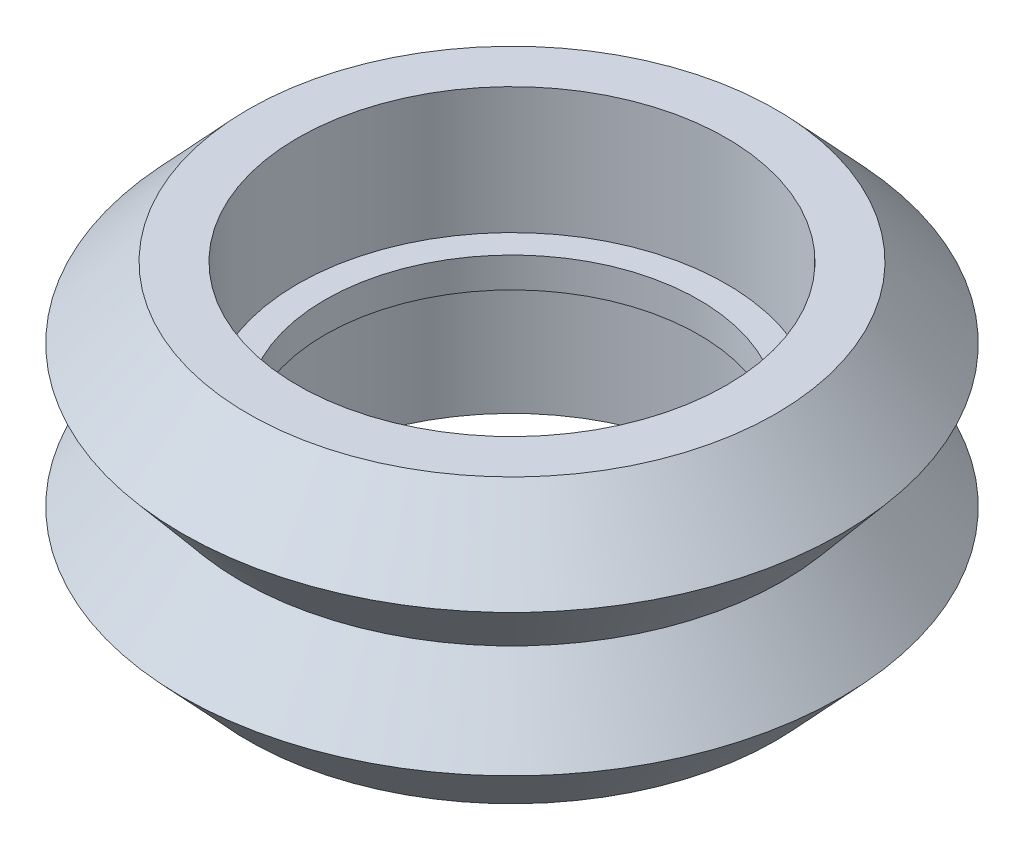
ISO-10303-21;
HEADER;
FILE_DESCRIPTION(('STEP AP214'),'2;1');
FILE_NAME('part.step','',(''),(''),'','','');
FILE_SCHEMA(('AUTOMOTIVE_DESIGN { 1 0 10303 214 1 1 1 1 }'));
ENDSEC;
DATA;
#1=APPLICATION_CONTEXT('core data for automotive mechanical design processes');
#2=APPLICATION_PROTOCOL_DEFINITION('international standard','automotive_design',2000,#1);
#3=PRODUCT_CONTEXT('',#1,'mechanical');
#4=PRODUCT('Part','Part','',(#3));
#5=PRODUCT_RELATED_PRODUCT_CATEGORY('part','',(#4));
#6=PRODUCT_DEFINITION_FORMATION('','',#4);
#7=PRODUCT_DEFINITION_CONTEXT('part definition',#1,'design');
#8=PRODUCT_DEFINITION('design','',#6,#7);
#9=PRODUCT_DEFINITION_SHAPE('','',#8);
#10=(LENGTH_UNIT() NAMED_UNIT(*) SI_UNIT(.MILLI.,.METRE.));
#11=(NAMED_UNIT(*) PLANE_ANGLE_UNIT() SI_UNIT($,.RADIAN.));
#12=(NAMED_UNIT(*) SI_UNIT($,.STERADIAN.) SOLID_ANGLE_UNIT());
#13=UNCERTAINTY_MEASURE_WITH_UNIT(LENGTH_MEASURE(1.E-05),#10,'distance_accuracy_value','');
#14=(GEOMETRIC_REPRESENTATION_CONTEXT(3) GLOBAL_UNCERTAINTY_ASSIGNED_CONTEXT((#13)) GLOBAL_UNIT_ASSIGNED_CONTEXT((#10,
#11,#12)) REPRESENTATION_CONTEXT('',''));
#15=CARTESIAN_POINT('',(0.,0.,0.));
#16=DIRECTION('',(0.,0.,1.));
#17=DIRECTION('',(1.,0.,0.));
#18=AXIS2_PLACEMENT_3D('',#15,#16,#17);
#19=CARTESIAN_POINT('',(6.44833164735955,3.01968441183526,-1.11761469901239));
#20=DIRECTION('',(0.,1.,0.));
#21=DIRECTION('',(1.,0.,0.));
#22=AXIS2_PLACEMENT_3D('',#19,#20,#21);
#23=PLANE('',#22);
#24=CARTESIAN_POINT('',(-1.35166835264044,3.01968441183526,-1.11761469901239));
#25=DIRECTION('',(0.,-1.,0.));
#26=DIRECTION('',(1.,0.,0.));
#27=AXIS2_PLACEMENT_3D('',#24,#25,#26);
#28=CIRCLE('',#27,7.8);
#29=CARTESIAN_POINT('',(6.44833164735955,3.01968441183526,-1.11761469901239));
#30=VERTEX_POINT('',#29);
#31=CARTESIAN_POINT('',(-9.15166835264044,3.01968441183526,-1.11761469901239));
#32=VERTEX_POINT('',#31);
#33=EDGE_CURVE('E40',#30,#32,#28,.T.);
#34=ORIENTED_EDGE('',*,*,#33,.F.);
#35=CARTESIAN_POINT('',(-1.35166835264044,3.01968441183526,-1.11761469901239));
#36=DIRECTION('',(0.,-1.,0.));
#37=DIRECTION('',(1.,0.,0.));
#38=AXIS2_PLACEMENT_3D('',#35,#36,#37);
#39=CIRCLE('',#38,7.8);
#40=EDGE_CURVE('E188',#32,#30,#39,.T.);
#41=ORIENTED_EDGE('',*,*,#40,.F.);
#42=EDGE_LOOP('',(#34,#41));
#43=FACE_BOUND('',#42,.T.);
#44=CARTESIAN_POINT('',(-1.35166835264044,3.01968441183526,-1.11761469901239));
#45=DIRECTION('',(0.,-1.,0.));
#46=DIRECTION('',(1.,0.,0.));
#47=AXIS2_PLACEMENT_3D('',#44,#45,#46);
#48=CIRCLE('',#47,6.8);
#49=CARTESIAN_POINT('',(5.44833164735955,3.01968441183526,-1.11761469901239));
#50=VERTEX_POINT('',#49);
#51=CARTESIAN_POINT('',(-8.15166835264045,3.01968441183526,-1.11761469901239));
#52=VERTEX_POINT('',#51);
#53=EDGE_CURVE('E10',#50,#52,#48,.T.);
#54=ORIENTED_EDGE('',*,*,#53,.T.);
#55=CARTESIAN_POINT('',(-1.35166835264044,3.01968441183526,-1.11761469901239));
#56=DIRECTION('',(0.,-1.,0.));
#57=DIRECTION('',(1.,0.,0.));
#58=AXIS2_PLACEMENT_3D('',#55,#56,#57);
#59=CIRCLE('',#58,6.8);
#60=EDGE_CURVE('E27',#52,#50,#59,.T.);
#61=ORIENTED_EDGE('',*,*,#60,.T.);
#62=EDGE_LOOP('',(#54,#61));
#63=FACE_BOUND('',#62,.T.);
#64=ADVANCED_FACE('F16',(#43,#63),#23,.T.);
#65=CARTESIAN_POINT('',(-1.35166835264044,5.31968441183526,-1.11761469901239));
#66=DIRECTION('',(0.,-1.,0.));
#67=DIRECTION('',(1.,0.,0.));
#68=AXIS2_PLACEMENT_3D('',#65,#66,#67);
#69=CYLINDRICAL_SURFACE('',#68,7.8);
#70=ORIENTED_EDGE('',*,*,#33,.T.);
#71=DIRECTION('',(0.,1.,0.));
#72=VECTOR('',#71,1.);
#73=CARTESIAN_POINT('',(-9.15166835264044,5.31968441183526,-1.11761469901239));
#74=LINE('',#73,#72);
#75=CARTESIAN_POINT('',(-9.15166835264044,7.61968441183526,-1.11761469901239));
#76=VERTEX_POINT('',#75);
#77=EDGE_CURVE('E176',#32,#76,#74,.T.);
#78=ORIENTED_EDGE('',*,*,#77,.T.);
#79=CARTESIAN_POINT('',(-1.35166835264044,7.61968441183526,-1.11761469901239));
#80=DIRECTION('',(0.,-1.,0.));
#81=DIRECTION('',(1.,0.,0.));
#82=AXIS2_PLACEMENT_3D('',#79,#80,#81);
#83=CIRCLE('',#82,7.8);
#84=CARTESIAN_POINT('',(6.44833164735955,7.61968441183526,-1.11761469901239));
#85=VERTEX_POINT('',#84);
#86=EDGE_CURVE('E192',#85,#76,#83,.T.);
#87=ORIENTED_EDGE('',*,*,#86,.F.);
#88=CARTESIAN_POINT('',(-1.35166835264044,7.61968441183526,-1.11761469901239));
#89=DIRECTION('',(0.,-1.,0.));
#90=DIRECTION('',(1.,0.,0.));
#91=AXIS2_PLACEMENT_3D('',#88,#89,#90);
#92=CIRCLE('',#91,7.8);
#93=EDGE_CURVE('E137',#76,#85,#92,.T.);
#94=ORIENTED_EDGE('',*,*,#93,.F.);
#95=ORIENTED_EDGE('',*,*,#77,.F.);
#96=ORIENTED_EDGE('',*,*,#40,.T.);
#97=EDGE_LOOP('',(#70,#78,#87,#94,#95,#96));
#98=FACE_BOUND('',#97,.T.);
#99=ADVANCED_FACE('F228',(#98),#69,.F.);
#100=CARTESIAN_POINT('',(8.24833164735955,7.61968441183526,-1.11761469901239));
#101=DIRECTION('',(0.,1.,0.));
#102=DIRECTION('',(1.,0.,0.));
#103=AXIS2_PLACEMENT_3D('',#100,#101,#102);
#104=PLANE('',#103);
#105=CARTESIAN_POINT('',(-1.35166835264044,7.61968441183526,-1.11761469901239));
#106=DIRECTION('',(0.,-1.,0.));
#107=DIRECTION('',(1.,0.,0.));
#108=AXIS2_PLACEMENT_3D('',#105,#106,#107);
#109=CIRCLE('',#108,9.6);
#110=CARTESIAN_POINT('',(8.24833164735955,7.61968441183526,-1.11761469901239));
#111=VERTEX_POINT('',#110);
#112=CARTESIAN_POINT('',(-10.9516683526404,7.61968441183526,-1.11761469901239));
#113=VERTEX_POINT('',#112);
#114=EDGE_CURVE('E133',#111,#113,#109,.T.);
#115=ORIENTED_EDGE('',*,*,#114,.F.);
#116=CARTESIAN_POINT('',(-1.35166835264044,7.61968441183526,-1.11761469901239));
#117=DIRECTION('',(0.,-1.,0.));
#118=DIRECTION('',(1.,0.,0.));
#119=AXIS2_PLACEMENT_3D('',#116,#117,#118);
#120=CIRCLE('',#119,9.6);
#121=EDGE_CURVE('E141',#113,#111,#120,.T.);
#122=ORIENTED_EDGE('',*,*,#121,.F.);
#123=EDGE_LOOP('',(#115,#122));
#124=FACE_BOUND('',#123,.T.);
#125=ORIENTED_EDGE('',*,*,#86,.T.);
#126=ORIENTED_EDGE('',*,*,#93,.T.);
#127=EDGE_LOOP('',(#125,#126));
#128=FACE_BOUND('',#127,.T.);
#129=ADVANCED_FACE('F18',(#124,#128),#104,.T.);
#130=CARTESIAN_POINT('',(-1.35166835264044,6.33218441183526,-1.11761469901239));
#131=DIRECTION('',(0.,-1.,0.));
#132=DIRECTION('',(1.,0.,0.));
#133=AXIS2_PLACEMENT_3D('',#130,#131,#132);
#134=CONICAL_SURFACE('',#133,10.8,0.75023678144242);
#135=CARTESIAN_POINT('',(-1.35166835264044,5.04468441183526,-1.11761469901239));
#136=DIRECTION('',(0.,-1.,0.));
#137=DIRECTION('',(1.,0.,0.));
#138=AXIS2_PLACEMENT_3D('',#135,#136,#137);
#139=CIRCLE('',#138,12.);
#140=CARTESIAN_POINT('',(10.6483316473596,5.04468441183526,-1.11761469901239));
#141=VERTEX_POINT('',#140);
#142=CARTESIAN_POINT('',(-13.3516683526404,5.04468441183526,-1.11761469901239));
#143=VERTEX_POINT('',#142);
#144=EDGE_CURVE('E113',#141,#143,#139,.T.);
#145=ORIENTED_EDGE('',*,*,#144,.F.);
#146=CARTESIAN_POINT('',(-1.35166835264044,5.04468441183526,-1.11761469901239));
#147=DIRECTION('',(0.,-1.,0.));
#148=DIRECTION('',(1.,0.,0.));
#149=AXIS2_PLACEMENT_3D('',#146,#147,#148);
#150=CIRCLE('',#149,12.);
#151=EDGE_CURVE('E117',#143,#141,#150,.T.);
#152=ORIENTED_EDGE('',*,*,#151,.F.);
#153=DIRECTION('',(0.681811991259297,0.731527448955288,0.));
#154=VECTOR('',#153,1.);
#155=CARTESIAN_POINT('',(-12.1516683526404,6.33218441183526,-1.11761469901239));
#156=LINE('',#155,#154);
#157=EDGE_CURVE('E118',#143,#113,#156,.T.);
#158=ORIENTED_EDGE('',*,*,#157,.T.);
#159=ORIENTED_EDGE('',*,*,#121,.T.);
#160=ORIENTED_EDGE('',*,*,#114,.T.);
#161=ORIENTED_EDGE('',*,*,#157,.F.);
#162=EDGE_LOOP('',(#145,#152,#158,#159,#160,#161));
#163=FACE_BOUND('',#162,.T.);
#164=ADVANCED_FACE('F115',(#163),#134,.T.);
#165=CARTESIAN_POINT('',(-1.35166835264044,3.75718441183526,-1.11761469901239));
#166=DIRECTION('',(0.,1.,0.));
#167=DIRECTION('',(1.,0.,0.));
#168=AXIS2_PLACEMENT_3D('',#165,#166,#167);
#169=CONICAL_SURFACE('',#168,10.925,0.695692474380389);
#170=CARTESIAN_POINT('',(-1.35166835264044,2.46968441183526,-1.11761469901239));
#171=DIRECTION('',(0.,-1.,0.));
#172=DIRECTION('',(1.,0.,0.));
#173=AXIS2_PLACEMENT_3D('',#170,#171,#172);
#174=CIRCLE('',#173,9.85);
#175=CARTESIAN_POINT('',(8.49833164735955,2.46968441183526,-1.11761469901239));
#176=VERTEX_POINT('',#175);
#177=CARTESIAN_POINT('',(-11.2016683526404,2.46968441183526,-1.11761469901239));
#178=VERTEX_POINT('',#177);
#179=EDGE_CURVE('E145',#176,#178,#174,.T.);
#180=ORIENTED_EDGE('',*,*,#179,.F.);
#181=CARTESIAN_POINT('',(-1.35166835264044,2.46968441183526,-1.11761469901239));
#182=DIRECTION('',(0.,-1.,0.));
#183=DIRECTION('',(1.,0.,0.));
#184=AXIS2_PLACEMENT_3D('',#181,#182,#183);
#185=CIRCLE('',#184,9.85);
#186=EDGE_CURVE('E162',#178,#176,#185,.T.);
#187=ORIENTED_EDGE('',*,*,#186,.F.);
#188=DIRECTION('',(-0.640917143460842,0.767610067168217,0.));
#189=VECTOR('',#188,1.);
#190=CARTESIAN_POINT('',(-12.2766683526404,3.75718441183526,-1.11761469901239));
#191=LINE('',#190,#189);
#192=EDGE_CURVE('E126',#178,#143,#191,.T.);
#193=ORIENTED_EDGE('',*,*,#192,.T.);
#194=ORIENTED_EDGE('',*,*,#151,.T.);
#195=ORIENTED_EDGE('',*,*,#144,.T.);
#196=ORIENTED_EDGE('',*,*,#192,.F.);
#197=EDGE_LOOP('',(#180,#187,#193,#194,#195,#196));
#198=FACE_BOUND('',#197,.T.);
#199=ADVANCED_FACE('F124',(#198),#169,.T.);
#200=CARTESIAN_POINT('',(-1.35166835264044,1.18218441183526,-1.11761469901239));
#201=DIRECTION('',(0.,-1.,0.));
#202=DIRECTION('',(1.,0.,0.));
#203=AXIS2_PLACEMENT_3D('',#200,#201,#202);
#204=CONICAL_SURFACE('',#203,10.925,0.695692474380389);
#205=CARTESIAN_POINT('',(-1.35166835264044,-0.10531558816474,-1.11761469901239));
#206=DIRECTION('',(0.,-1.,0.));
#207=DIRECTION('',(1.,0.,0.));
#208=AXIS2_PLACEMENT_3D('',#205,#206,#207);
#209=CIRCLE('',#208,12.);
#210=CARTESIAN_POINT('',(10.6483316473596,-0.10531558816474,-1.11761469901239));
#211=VERTEX_POINT('',#210);
#212=CARTESIAN_POINT('',(-13.3516683526404,-0.10531558816474,-1.11761469901239));
#213=VERTEX_POINT('',#212);
#214=EDGE_CURVE('E170',#211,#213,#209,.T.);
#215=ORIENTED_EDGE('',*,*,#214,.F.);
#216=CARTESIAN_POINT('',(-1.35166835264044,-0.10531558816474,-1.11761469901239));
#217=DIRECTION('',(0.,-1.,0.));
#218=DIRECTION('',(1.,0.,0.));
#219=AXIS2_PLACEMENT_3D('',#216,#217,#218);
#220=CIRCLE('',#219,12.);
#221=EDGE_CURVE('E146',#213,#211,#220,.T.);
#222=ORIENTED_EDGE('',*,*,#221,.F.);
#223=DIRECTION('',(0.640917143460842,0.767610067168217,0.));
#224=VECTOR('',#223,1.);
#225=CARTESIAN_POINT('',(-12.2766683526404,1.18218441183526,-1.11761469901239));
#226=LINE('',#225,#224);
#227=EDGE_CURVE('E20',#213,#178,#226,.T.);
#228=ORIENTED_EDGE('',*,*,#227,.T.);
#229=ORIENTED_EDGE('',*,*,#186,.T.);
#230=ORIENTED_EDGE('',*,*,#179,.T.);
#231=ORIENTED_EDGE('',*,*,#227,.F.);
#232=EDGE_LOOP('',(#215,#222,#228,#229,#230,#231));
#233=FACE_BOUND('',#232,.T.);
#234=ADVANCED_FACE('F222',(#233),#204,.T.);
#235=CARTESIAN_POINT('',(-1.35166835264044,-1.39281558816474,-1.11761469901239));
#236=DIRECTION('',(0.,1.,0.));
#237=DIRECTION('',(1.,0.,0.));
#238=AXIS2_PLACEMENT_3D('',#235,#236,#237);
#239=CONICAL_SURFACE('',#238,10.8,0.75023678144242);
#240=CARTESIAN_POINT('',(-1.35166835264044,-2.68031558816474,-1.11761469901239));
#241=DIRECTION('',(0.,-1.,0.));
#242=DIRECTION('',(1.,0.,0.));
#243=AXIS2_PLACEMENT_3D('',#240,#241,#242);
#244=CIRCLE('',#243,9.6);
#245=CARTESIAN_POINT('',(8.24833164735955,-2.68031558816474,-1.11761469901239));
#246=VERTEX_POINT('',#245);
#247=CARTESIAN_POINT('',(-10.9516683526404,-2.68031558816474,-1.11761469901239));
#248=VERTEX_POINT('',#247);
#249=EDGE_CURVE('E166',#246,#248,#244,.T.);
#250=ORIENTED_EDGE('',*,*,#249,.F.);
#251=CARTESIAN_POINT('',(-1.35166835264044,-2.68031558816474,-1.11761469901239));
#252=DIRECTION('',(0.,-1.,0.));
#253=DIRECTION('',(1.,0.,0.));
#254=AXIS2_PLACEMENT_3D('',#251,#252,#253);
#255=CIRCLE('',#254,9.6);
#256=EDGE_CURVE('E155',#248,#246,#255,.T.);
#257=ORIENTED_EDGE('',*,*,#256,.F.);
#258=DIRECTION('',(-0.681811991259297,0.731527448955288,0.));
#259=VECTOR('',#258,1.);
#260=CARTESIAN_POINT('',(-12.1516683526404,-1.39281558816474,-1.11761469901239));
#261=LINE('',#260,#259);
#262=EDGE_CURVE('E142',#248,#213,#261,.T.);
#263=ORIENTED_EDGE('',*,*,#262,.T.);
#264=ORIENTED_EDGE('',*,*,#221,.T.);
#265=ORIENTED_EDGE('',*,*,#214,.T.);
#266=ORIENTED_EDGE('',*,*,#262,.F.);
#267=EDGE_LOOP('',(#250,#257,#263,#264,#265,#266));
#268=FACE_BOUND('',#267,.T.);
#269=ADVANCED_FACE('F213',(#268),#239,.T.);
#270=CARTESIAN_POINT('',(6.44833164735955,-2.68031558816474,-1.11761469901239));
#271=DIRECTION('',(0.,-1.,0.));
#272=DIRECTION('',(0.,0.,-1.));
#273=AXIS2_PLACEMENT_3D('',#270,#271,#272);
#274=PLANE('',#273);
#275=ORIENTED_EDGE('',*,*,#249,.T.);
#276=ORIENTED_EDGE('',*,*,#256,.T.);
#277=EDGE_LOOP('',(#275,#276));
#278=FACE_BOUND('',#277,.T.);
#279=CARTESIAN_POINT('',(-1.35166835264044,-2.68031558816474,-1.11761469901239));
#280=DIRECTION('',(0.,-1.,0.));
#281=DIRECTION('',(1.,0.,0.));
#282=AXIS2_PLACEMENT_3D('',#279,#280,#281);
#283=CIRCLE('',#282,7.8);
#284=CARTESIAN_POINT('',(6.44833164735955,-2.68031558816474,-1.11761469901239));
#285=VERTEX_POINT('',#284);
#286=CARTESIAN_POINT('',(-9.15166835264044,-2.68031558816474,-1.11761469901239));
#287=VERTEX_POINT('',#286);
#288=EDGE_CURVE('E151',#285,#287,#283,.T.);
#289=ORIENTED_EDGE('',*,*,#288,.F.);
#290=CARTESIAN_POINT('',(-1.35166835264044,-2.68031558816474,-1.11761469901239));
#291=DIRECTION('',(0.,-1.,0.));
#292=DIRECTION('',(1.,0.,0.));
#293=AXIS2_PLACEMENT_3D('',#290,#291,#292);
#294=CIRCLE('',#293,7.8);
#295=EDGE_CURVE('E193',#287,#285,#294,.T.);
#296=ORIENTED_EDGE('',*,*,#295,.F.);
#297=EDGE_LOOP('',(#289,#296));
#298=FACE_BOUND('',#297,.T.);
#299=ADVANCED_FACE('F211',(#278,#298),#274,.T.);
#300=CARTESIAN_POINT('',(-1.35166835264044,-0.38031558816474,-1.11761469901239));
#301=DIRECTION('',(0.,-1.,0.));
#302=DIRECTION('',(1.,0.,0.));
#303=AXIS2_PLACEMENT_3D('',#300,#301,#302);
#304=CYLINDRICAL_SURFACE('',#303,7.8);
#305=ORIENTED_EDGE('',*,*,#288,.T.);
#306=DIRECTION('',(0.,1.,0.));
#307=VECTOR('',#306,1.);
#308=CARTESIAN_POINT('',(-9.15166835264044,-0.38031558816474,-1.11761469901239));
#309=LINE('',#308,#307);
#310=CARTESIAN_POINT('',(-9.15166835264044,1.91968441183526,-1.11761469901239));
#311=VERTEX_POINT('',#310);
#312=EDGE_CURVE('E156',#287,#311,#309,.T.);
#313=ORIENTED_EDGE('',*,*,#312,.T.);
#314=CARTESIAN_POINT('',(-1.35166835264044,1.91968441183526,-1.11761469901239));
#315=DIRECTION('',(0.,-1.,0.));
#316=DIRECTION('',(1.,0.,0.));
#317=AXIS2_PLACEMENT_3D('',#314,#315,#316);
#318=CIRCLE('',#317,7.8);
#319=CARTESIAN_POINT('',(6.44833164735955,1.91968441183526,-1.11761469901239));
#320=VERTEX_POINT('',#319);
#321=EDGE_CURVE('E184',#320,#311,#318,.T.);
#322=ORIENTED_EDGE('',*,*,#321,.F.);
#323=CARTESIAN_POINT('',(-1.35166835264044,1.91968441183526,-1.11761469901239));
#324=DIRECTION('',(0.,-1.,0.));
#325=DIRECTION('',(1.,0.,0.));
#326=AXIS2_PLACEMENT_3D('',#323,#324,#325);
#327=CIRCLE('',#326,7.8);
#328=EDGE_CURVE('E180',#311,#320,#327,.T.);
#329=ORIENTED_EDGE('',*,*,#328,.F.);
#330=ORIENTED_EDGE('',*,*,#312,.F.);
#331=ORIENTED_EDGE('',*,*,#295,.T.);
#332=EDGE_LOOP('',(#305,#313,#322,#329,#330,#331));
#333=FACE_BOUND('',#332,.T.);
#334=ADVANCED_FACE('F209',(#333),#304,.F.);
#335=CARTESIAN_POINT('',(5.44833164735955,1.91968441183526,-1.11761469901239));
#336=DIRECTION('',(0.,-1.,0.));
#337=DIRECTION('',(0.,0.,-1.));
#338=AXIS2_PLACEMENT_3D('',#335,#336,#337);
#339=PLANE('',#338);
#340=ORIENTED_EDGE('',*,*,#321,.T.);
#341=ORIENTED_EDGE('',*,*,#328,.T.);
#342=EDGE_LOOP('',(#340,#341));
#343=FACE_BOUND('',#342,.T.);
#344=CARTESIAN_POINT('',(-1.35166835264044,1.91968441183526,-1.11761469901239));
#345=DIRECTION('',(0.,-1.,0.));
#346=DIRECTION('',(1.,0.,0.));
#347=AXIS2_PLACEMENT_3D('',#344,#345,#346);
#348=CIRCLE('',#347,6.8);
#349=CARTESIAN_POINT('',(5.44833164735955,1.91968441183526,-1.11761469901239));
#350=VERTEX_POINT('',#349);
#351=CARTESIAN_POINT('',(-8.15166835264045,1.91968441183526,-1.11761469901239));
#352=VERTEX_POINT('',#351);
#353=EDGE_CURVE('E185',#350,#352,#348,.T.);
#354=ORIENTED_EDGE('',*,*,#353,.F.);
#355=CARTESIAN_POINT('',(-1.35166835264044,1.91968441183526,-1.11761469901239));
#356=DIRECTION('',(0.,-1.,0.));
#357=DIRECTION('',(1.,0.,0.));
#358=AXIS2_PLACEMENT_3D('',#355,#356,#357);
#359=CIRCLE('',#358,6.8);
#360=EDGE_CURVE('E157',#352,#350,#359,.T.);
#361=ORIENTED_EDGE('',*,*,#360,.F.);
#362=EDGE_LOOP('',(#354,#361));
#363=FACE_BOUND('',#362,.T.);
#364=ADVANCED_FACE('F204',(#343,#363),#339,.T.);
#365=CARTESIAN_POINT('',(-1.35166835264044,2.46968441183526,-1.11761469901239));
#366=DIRECTION('',(0.,-1.,0.));
#367=DIRECTION('',(1.,0.,0.));
#368=AXIS2_PLACEMENT_3D('',#365,#366,#367);
#369=CYLINDRICAL_SURFACE('',#368,6.8);
#370=ORIENTED_EDGE('',*,*,#353,.T.);
#371=DIRECTION('',(0.,1.,0.));
#372=VECTOR('',#371,1.);
#373=CARTESIAN_POINT('',(-8.15166835264045,2.46968441183526,-1.11761469901239));
#374=LINE('',#373,#372);
#375=EDGE_CURVE('E161',#352,#52,#374,.T.);
#376=ORIENTED_EDGE('',*,*,#375,.T.);
#377=ORIENTED_EDGE('',*,*,#53,.F.);
#378=ORIENTED_EDGE('',*,*,#60,.F.);
#379=ORIENTED_EDGE('',*,*,#375,.F.);
#380=ORIENTED_EDGE('',*,*,#360,.T.);
#381=EDGE_LOOP('',(#370,#376,#377,#378,#379,#380));
#382=FACE_BOUND('',#381,.T.);
#383=ADVANCED_FACE('F236',(#382),#369,.F.);
#384=CLOSED_SHELL('',(#64,#99,#129,#164,#199,#234,#269,#299,#334,#364,#383));
#385=MANIFOLD_SOLID_BREP('B1',#384);
#386=ADVANCED_BREP_SHAPE_REPRESENTATION('',(#18,#385),#14);
#387=SHAPE_DEFINITION_REPRESENTATION(#9,#386);
ENDSEC;
END-ISO-10303-21;
